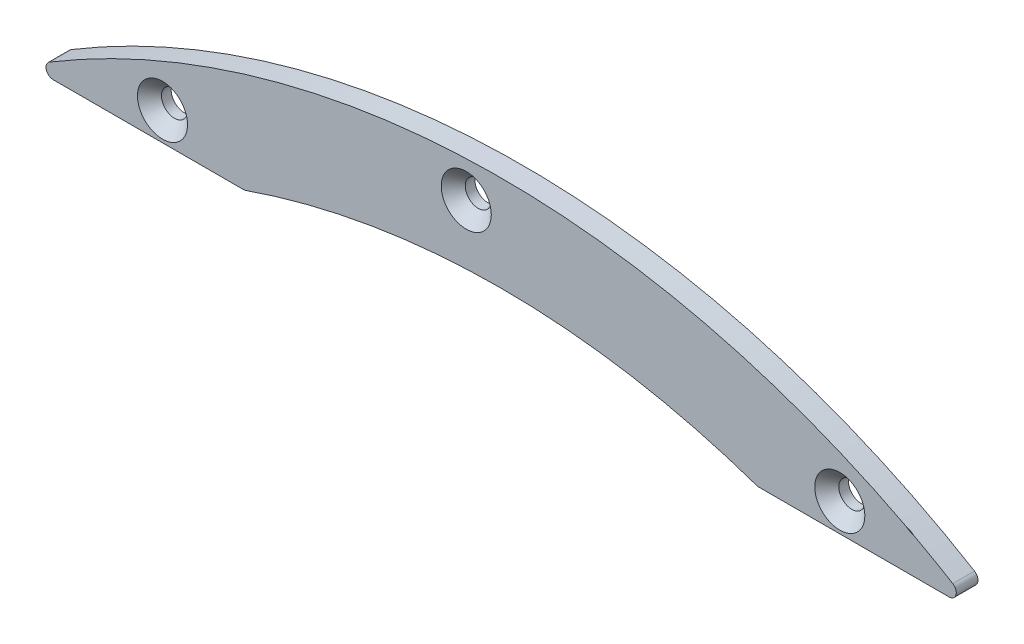
ISO-10303-21;
HEADER;
FILE_DESCRIPTION(('STEP AP214'),'2;1');
FILE_NAME('part.step','',(''),(''),'','','');
FILE_SCHEMA(('AUTOMOTIVE_DESIGN { 1 0 10303 214 1 1 1 1 }'));
ENDSEC;
DATA;
#1=APPLICATION_CONTEXT('core data for automotive mechanical design processes');
#2=APPLICATION_PROTOCOL_DEFINITION('international standard','automotive_design',2000,#1);
#3=PRODUCT_CONTEXT('',#1,'mechanical');
#4=PRODUCT('Part','Part','',(#3));
#5=PRODUCT_RELATED_PRODUCT_CATEGORY('part','',(#4));
#6=PRODUCT_DEFINITION_FORMATION('','',#4);
#7=PRODUCT_DEFINITION_CONTEXT('part definition',#1,'design');
#8=PRODUCT_DEFINITION('design','',#6,#7);
#9=PRODUCT_DEFINITION_SHAPE('','',#8);
#10=(LENGTH_UNIT() NAMED_UNIT(*) SI_UNIT(.MILLI.,.METRE.));
#11=(NAMED_UNIT(*) PLANE_ANGLE_UNIT() SI_UNIT($,.RADIAN.));
#12=(NAMED_UNIT(*) SI_UNIT($,.STERADIAN.) SOLID_ANGLE_UNIT());
#13=UNCERTAINTY_MEASURE_WITH_UNIT(LENGTH_MEASURE(1.E-05),#10,'distance_accuracy_value','');
#14=(GEOMETRIC_REPRESENTATION_CONTEXT(3) GLOBAL_UNCERTAINTY_ASSIGNED_CONTEXT((#13)) GLOBAL_UNIT_ASSIGNED_CONTEXT((#10,
#11,#12)) REPRESENTATION_CONTEXT('',''));
#15=CARTESIAN_POINT('',(0.,0.,0.));
#16=DIRECTION('',(0.,0.,1.));
#17=DIRECTION('',(1.,0.,0.));
#18=AXIS2_PLACEMENT_3D('',#15,#16,#17);
#19=CARTESIAN_POINT('',(0.,0.,3.75));
#20=DIRECTION('',(0.,0.,-1.));
#21=DIRECTION('',(-1.,0.,0.));
#22=AXIS2_PLACEMENT_3D('',#19,#20,#21);
#23=CYLINDRICAL_SURFACE('',#22,269.460029069767);
#24=CARTESIAN_POINT('',(0.,0.,-3.75));
#25=DIRECTION('',(0.,0.,-1.));
#26=DIRECTION('',(1.,0.,0.));
#27=AXIS2_PLACEMENT_3D('',#24,#25,#26);
#28=CIRCLE('',#27,269.460029069767);
#29=CARTESIAN_POINT('',(-88.6498780151052,254.460029069767,-3.75));
#30=VERTEX_POINT('',#29);
#31=CARTESIAN_POINT('',(88.6498780151052,254.460029069767,-3.75));
#32=VERTEX_POINT('',#31);
#33=EDGE_CURVE('E245',#30,#32,#28,.T.);
#34=ORIENTED_EDGE('',*,*,#33,.T.);
#35=DIRECTION('',(0.,0.,-1.));
#36=VECTOR('',#35,1.);
#37=CARTESIAN_POINT('',(88.6498780151052,254.460029069767,3.75));
#38=LINE('',#37,#36);
#39=CARTESIAN_POINT('',(88.6498780151052,254.460029069767,3.75));
#40=VERTEX_POINT('',#39);
#41=EDGE_CURVE('E49',#40,#32,#38,.T.);
#42=ORIENTED_EDGE('',*,*,#41,.F.);
#43=CARTESIAN_POINT('',(0.,0.,3.75));
#44=DIRECTION('',(0.,0.,-1.));
#45=DIRECTION('',(1.,0.,0.));
#46=AXIS2_PLACEMENT_3D('',#43,#44,#45);
#47=CIRCLE('',#46,269.460029069767);
#48=CARTESIAN_POINT('',(-88.6498780151052,254.460029069767,3.75));
#49=VERTEX_POINT('',#48);
#50=EDGE_CURVE('E246',#49,#40,#47,.T.);
#51=ORIENTED_EDGE('',*,*,#50,.F.);
#52=DIRECTION('',(0.,0.,-1.));
#53=VECTOR('',#52,1.);
#54=CARTESIAN_POINT('',(-88.6498780151052,254.460029069767,3.75));
#55=LINE('',#54,#53);
#56=EDGE_CURVE('E262',#49,#30,#55,.T.);
#57=ORIENTED_EDGE('',*,*,#56,.T.);
#58=EDGE_LOOP('',(#34,#42,#51,#57));
#59=FACE_BOUND('',#58,.T.);
#60=ADVANCED_FACE('F37',(#59),#23,.F.);
#61=CARTESIAN_POINT('',(88.6498780151052,254.460029069767,3.75));
#62=DIRECTION('',(0.,1.,0.));
#63=DIRECTION('',(-1.,0.,0.));
#64=AXIS2_PLACEMENT_3D('',#61,#62,#63);
#65=PLANE('',#64);
#66=DIRECTION('',(1.,0.,0.));
#67=VECTOR('',#66,1.);
#68=CARTESIAN_POINT('',(88.6498780151052,254.460029069767,-3.75));
#69=LINE('',#68,#67);
#70=CARTESIAN_POINT('',(154.75,254.460029069768,-3.75));
#71=VERTEX_POINT('',#70);
#72=EDGE_CURVE('E265',#32,#71,#69,.T.);
#73=ORIENTED_EDGE('',*,*,#72,.T.);
#74=DIRECTION('',(0.,0.,-1.));
#75=VECTOR('',#74,1.);
#76=CARTESIAN_POINT('',(154.75,254.460029069768,3.75));
#77=LINE('',#76,#75);
#78=CARTESIAN_POINT('',(154.75,254.460029069768,3.75));
#79=VERTEX_POINT('',#78);
#80=EDGE_CURVE('E285',#79,#71,#77,.T.);
#81=ORIENTED_EDGE('',*,*,#80,.F.);
#82=DIRECTION('',(1.,0.,0.));
#83=VECTOR('',#82,1.);
#84=CARTESIAN_POINT('',(88.6498780151052,254.460029069767,3.75));
#85=LINE('',#84,#83);
#86=EDGE_CURVE('E249',#40,#79,#85,.T.);
#87=ORIENTED_EDGE('',*,*,#86,.F.);
#88=ORIENTED_EDGE('',*,*,#41,.T.);
#89=EDGE_LOOP('',(#73,#81,#87,#88));
#90=FACE_BOUND('',#89,.T.);
#91=ADVANCED_FACE('F290',(#90),#65,.F.);
#92=CARTESIAN_POINT('',(154.75,256.960029069768,3.75));
#93=DIRECTION('',(0.,0.,-1.));
#94=DIRECTION('',(-1.,0.,0.));
#95=AXIS2_PLACEMENT_3D('',#92,#93,#94);
#96=CYLINDRICAL_SURFACE('',#95,2.50000000000002);
#97=CARTESIAN_POINT('',(154.75,256.960029069768,-3.75));
#98=DIRECTION('',(0.,0.,1.));
#99=DIRECTION('',(-1.,0.,0.));
#100=AXIS2_PLACEMENT_3D('',#97,#98,#99);
#101=CIRCLE('',#100,2.50000000000002);
#102=CARTESIAN_POINT('',(156.039755175714,259.101647987017,-3.75));
#103=VERTEX_POINT('',#102);
#104=EDGE_CURVE('E267',#71,#103,#101,.T.);
#105=ORIENTED_EDGE('',*,*,#104,.T.);
#106=DIRECTION('',(0.,0.,-1.));
#107=VECTOR('',#106,1.);
#108=CARTESIAN_POINT('',(156.039755175714,259.101647987017,3.75));
#109=LINE('',#108,#107);
#110=CARTESIAN_POINT('',(156.039755175714,259.101647987017,3.75));
#111=VERTEX_POINT('',#110);
#112=EDGE_CURVE('E282',#111,#103,#109,.T.);
#113=ORIENTED_EDGE('',*,*,#112,.F.);
#114=CARTESIAN_POINT('',(154.75,256.960029069768,3.75));
#115=DIRECTION('',(0.,0.,1.));
#116=DIRECTION('',(-1.,0.,0.));
#117=AXIS2_PLACEMENT_3D('',#114,#115,#116);
#118=CIRCLE('',#117,2.50000000000002);
#119=EDGE_CURVE('E252',#79,#111,#118,.T.);
#120=ORIENTED_EDGE('',*,*,#119,.F.);
#121=ORIENTED_EDGE('',*,*,#80,.T.);
#122=EDGE_LOOP('',(#105,#113,#120,#121));
#123=FACE_BOUND('',#122,.T.);
#124=ADVANCED_FACE('F304',(#123),#96,.T.);
#125=CARTESIAN_POINT('',(0.,0.,3.75));
#126=DIRECTION('',(0.,0.,-1.));
#127=DIRECTION('',(-1.,0.,0.));
#128=AXIS2_PLACEMENT_3D('',#125,#126,#127);
#129=CYLINDRICAL_SURFACE('',#128,302.460029069768);
#130=CARTESIAN_POINT('',(0.,0.,3.75));
#131=DIRECTION('',(0.,0.,1.));
#132=DIRECTION('',(1.,0.,0.));
#133=AXIS2_PLACEMENT_3D('',#130,#131,#132);
#134=CIRCLE('',#133,302.460029069768);
#135=CARTESIAN_POINT('',(139.908199105441,268.156232461519,3.75));
#136=VERTEX_POINT('',#135);
#137=CARTESIAN_POINT('',(-156.039755175714,259.101647987017,3.75));
#138=VERTEX_POINT('',#137);
#139=EDGE_CURVE('E254',#136,#138,#134,.T.);
#140=ORIENTED_EDGE('',*,*,#139,.F.);
#141=CARTESIAN_POINT('',(132.619219648402,271.83489798908,8.11158046407223));
#142=CARTESIAN_POINT('',(132.834596791155,271.72982163131,7.92778525092383));
#143=CARTESIAN_POINT('',(133.051087469922,271.623887092947,7.74575499076126));
#144=CARTESIAN_POINT('',(133.486790906237,271.410030936583,7.38603458867117));
#145=CARTESIAN_POINT('',(133.706004415415,271.302108765744,7.20834568721867));
#146=CARTESIAN_POINT('',(134.149335410221,271.083172809987,6.8567892377176));
#147=CARTESIAN_POINT('',(134.373478355662,270.972140943511,6.68296490643369));
#148=CARTESIAN_POINT('',(134.825430855283,270.747550427584,6.34186538690266));
#149=CARTESIAN_POINT('',(135.053240080029,270.633992004812,6.17458961481791));
#150=CARTESIAN_POINT('',(135.518238879471,270.401451885659,5.8444821739536));
#151=CARTESIAN_POINT('',(135.755524501654,270.282405801571,5.6818303146494));
#152=CARTESIAN_POINT('',(136.235360150961,270.040863552464,5.36701771275158));
#153=CARTESIAN_POINT('',(136.477911111874,269.918366774312,5.21485885137153));
#154=CARTESIAN_POINT('',(136.96815021038,269.669928398661,4.92429978269551));
#155=CARTESIAN_POINT('',(137.215818424359,269.543999711008,4.78585520650044));
#156=CARTESIAN_POINT('',(137.717620099305,269.287960292444,4.52567972805737));
#157=CARTESIAN_POINT('',(137.971750031574,269.157851834266,4.4039399263188));
#158=CARTESIAN_POINT('',(138.365602237278,268.955484783335,4.23378153011675));
#159=CARTESIAN_POINT('',(138.502893573918,268.884811489796,4.17781584787327));
#160=CARTESIAN_POINT('',(138.779385264753,268.74221032141,4.07246100493958));
#161=CARTESIAN_POINT('',(138.918585943761,268.670282232519,4.0230729789231));
#162=CARTESIAN_POINT('',(139.198459564904,268.525385785394,3.93172243105801));
#163=CARTESIAN_POINT('',(139.339128577233,268.452420075009,3.88974375306163));
#164=CARTESIAN_POINT('',(139.622055436372,268.305378706963,3.8137966635688));
#165=CARTESIAN_POINT('',(139.764313370396,268.231302988297,3.77982869405373));
#166=CARTESIAN_POINT('',(140.094196106521,268.05919092913,3.71144117228976));
#167=CARTESIAN_POINT('',(140.282292330875,267.960805126015,3.68010797734714));
#168=CARTESIAN_POINT('',(140.659867921804,267.762798360052,3.63348297272452));
#169=CARTESIAN_POINT('',(140.849347479274,267.663177225355,3.61819342082291));
#170=CARTESIAN_POINT('',(141.228465171578,267.463335245953,3.60428887464884));
#171=CARTESIAN_POINT('',(141.418103152349,267.363114779461,3.60566428721031));
#172=CARTESIAN_POINT('',(141.796440150967,267.162655601208,3.62501219674104));
#173=CARTESIAN_POINT('',(141.985139510059,267.062416912283,3.64297813884756));
#174=CARTESIAN_POINT('',(142.251451358853,266.920590663808,3.67970358782871));
#175=CARTESIAN_POINT('',(142.329892272458,266.878771756867,3.69193432720546));
#176=CARTESIAN_POINT('',(142.486325107912,266.795285188644,3.71907693156385));
#177=CARTESIAN_POINT('',(142.564317275037,266.7536174505,3.73398715208433));
#178=CARTESIAN_POINT('',(142.871788062169,266.589176741619,3.7980846923937));
#179=CARTESIAN_POINT('',(143.099564268443,266.466975780521,3.85733243677375));
#180=CARTESIAN_POINT('',(143.437545135743,266.285103391195,3.96109326602686));
#181=CARTESIAN_POINT('',(143.549707015845,266.224654897987,3.99820843183271));
#182=CARTESIAN_POINT('',(143.772658966028,266.104317398409,4.07699932231332));
#183=CARTESIAN_POINT('',(143.883449579161,266.044428173023,4.11867317283399));
#184=CARTESIAN_POINT('',(143.993570671845,265.984813081606,4.16244226175853));
#185=B_SPLINE_CURVE_WITH_KNOTS('',3,(#141,#142,#143,#144,#145,#146,#147,#148,#149,#150,#151,
#152,#153,#154,#155,#156,#157,#158,#159,#160,#161,#162,#163,#164,#165,#166,#167,#168,#169,#170,
#171,#172,#173,#174,#175,#176,#177,#178,#179,#180,#181,#182,#183,#184),.UNSPECIFIED.,.F.,.F.,(4,
2,2,2,2,2,2,2,2,2,2,2,2,2,2,2,2,2,2,2,2,4),(0.,0.906044276811157,1.81234448348939,
2.72606745065089,3.6397087683376,4.57353350298285,5.50752522337396,6.43838917044575,
7.36875525695322,7.86136221844393,8.35405404697245,8.84565791526838,9.33728890088448,
9.98041683065181,10.6236352539362,11.266483426935,11.9090777213901,12.1782326675863,
12.4472229876587,13.2416866624306,13.6397529346652,14.0376561656928),.UNSPECIFIED.);
#186=CARTESIAN_POINT('',(142.641129207056,266.712537094566,3.75));
#187=VERTEX_POINT('',#186);
#188=EDGE_CURVE('E11',#136,#187,#185,.T.);
#189=ORIENTED_EDGE('',*,*,#188,.T.);
#190=EDGE_CURVE('E255',#111,#187,#134,.T.);
#191=ORIENTED_EDGE('',*,*,#190,.F.);
#192=ORIENTED_EDGE('',*,*,#112,.T.);
#193=CARTESIAN_POINT('',(0.,0.,-3.75));
#194=DIRECTION('',(0.,0.,1.));
#195=DIRECTION('',(1.,0.,0.));
#196=AXIS2_PLACEMENT_3D('',#193,#194,#195);
#197=CIRCLE('',#196,302.460029069768);
#198=CARTESIAN_POINT('',(-156.039755175714,259.101647987017,-3.75));
#199=VERTEX_POINT('',#198);
#200=EDGE_CURVE('E269',#103,#199,#197,.T.);
#201=ORIENTED_EDGE('',*,*,#200,.T.);
#202=DIRECTION('',(0.,0.,-1.));
#203=VECTOR('',#202,1.);
#204=CARTESIAN_POINT('',(-156.039755175714,259.101647987017,3.75));
#205=LINE('',#204,#203);
#206=EDGE_CURVE('E279',#138,#199,#205,.T.);
#207=ORIENTED_EDGE('',*,*,#206,.F.);
#208=EDGE_LOOP('',(#140,#189,#191,#192,#201,#207));
#209=FACE_BOUND('',#208,.T.);
#210=ADVANCED_FACE('F309',(#209),#129,.T.);
#211=CARTESIAN_POINT('',(-154.75,256.960029069767,3.75));
#212=DIRECTION('',(0.,0.,-1.));
#213=DIRECTION('',(-1.,0.,0.));
#214=AXIS2_PLACEMENT_3D('',#211,#212,#213);
#215=CYLINDRICAL_SURFACE('',#214,2.49999999999999);
#216=CARTESIAN_POINT('',(-154.75,256.960029069767,-3.75));
#217=DIRECTION('',(0.,0.,1.));
#218=DIRECTION('',(1.,0.,0.));
#219=AXIS2_PLACEMENT_3D('',#216,#217,#218);
#220=CIRCLE('',#219,2.49999999999999);
#221=CARTESIAN_POINT('',(-154.75,254.460029069768,-3.75));
#222=VERTEX_POINT('',#221);
#223=EDGE_CURVE('E271',#199,#222,#220,.T.);
#224=ORIENTED_EDGE('',*,*,#223,.T.);
#225=DIRECTION('',(0.,0.,-1.));
#226=VECTOR('',#225,1.);
#227=CARTESIAN_POINT('',(-154.75,254.460029069768,3.75));
#228=LINE('',#227,#226);
#229=CARTESIAN_POINT('',(-154.75,254.460029069768,3.75));
#230=VERTEX_POINT('',#229);
#231=EDGE_CURVE('E276',#230,#222,#228,.T.);
#232=ORIENTED_EDGE('',*,*,#231,.F.);
#233=CARTESIAN_POINT('',(-154.75,256.960029069767,3.75));
#234=DIRECTION('',(0.,0.,1.));
#235=DIRECTION('',(1.,0.,0.));
#236=AXIS2_PLACEMENT_3D('',#233,#234,#235);
#237=CIRCLE('',#236,2.49999999999999);
#238=EDGE_CURVE('E258',#138,#230,#237,.T.);
#239=ORIENTED_EDGE('',*,*,#238,.F.);
#240=ORIENTED_EDGE('',*,*,#206,.T.);
#241=EDGE_LOOP('',(#224,#232,#239,#240));
#242=FACE_BOUND('',#241,.T.);
#243=ADVANCED_FACE('F319',(#242),#215,.T.);
#244=CARTESIAN_POINT('',(-154.75,254.460029069768,3.75));
#245=DIRECTION('',(0.,1.,0.));
#246=DIRECTION('',(-1.,0.,0.));
#247=AXIS2_PLACEMENT_3D('',#244,#245,#246);
#248=PLANE('',#247);
#249=DIRECTION('',(1.,0.,0.));
#250=VECTOR('',#249,1.);
#251=CARTESIAN_POINT('',(-154.75,254.460029069768,-3.75));
#252=LINE('',#251,#250);
#253=EDGE_CURVE('E250',#222,#30,#252,.T.);
#254=ORIENTED_EDGE('',*,*,#253,.T.);
#255=ORIENTED_EDGE('',*,*,#56,.F.);
#256=DIRECTION('',(1.,0.,0.));
#257=VECTOR('',#256,1.);
#258=CARTESIAN_POINT('',(-154.75,254.460029069768,3.75));
#259=LINE('',#258,#257);
#260=EDGE_CURVE('E260',#230,#49,#259,.T.);
#261=ORIENTED_EDGE('',*,*,#260,.F.);
#262=ORIENTED_EDGE('',*,*,#231,.T.);
#263=EDGE_LOOP('',(#254,#255,#261,#262));
#264=FACE_BOUND('',#263,.T.);
#265=ADVANCED_FACE('F317',(#264),#248,.F.);
#266=CARTESIAN_POINT('',(0.,0.,3.75));
#267=DIRECTION('',(0.,0.,1.));
#268=DIRECTION('',(1.,0.,0.));
#269=AXIS2_PLACEMENT_3D('',#266,#267,#268);
#270=PLANE('',#269);
#271=CARTESIAN_POINT('',(-12.0579457489201,289.731675965508,3.75));
#272=DIRECTION('',(0.,0.,1.));
#273=DIRECTION('',(1.,0.,0.));
#274=AXIS2_PLACEMENT_3D('',#271,#272,#273);
#275=CIRCLE('',#274,8.65);
#276=CARTESIAN_POINT('',(-3.40794574892014,289.731675965508,3.75));
#277=VERTEX_POINT('',#276);
#278=EDGE_CURVE('E206',#277,#277,#275,.T.);
#279=ORIENTED_EDGE('',*,*,#278,.F.);
#280=EDGE_LOOP('',(#279));
#281=FACE_BOUND('',#280,.T.);
#282=CARTESIAN_POINT('',(117.,264.213736206127,3.75));
#283=DIRECTION('',(0.,0.,1.));
#284=DIRECTION('',(1.,0.,0.));
#285=AXIS2_PLACEMENT_3D('',#282,#283,#284);
#286=CIRCLE('',#285,8.65000000000001);
#287=CARTESIAN_POINT('',(125.65,264.213736206127,3.75));
#288=VERTEX_POINT('',#287);
#289=EDGE_CURVE('E226',#288,#288,#286,.T.);
#290=ORIENTED_EDGE('',*,*,#289,.F.);
#291=EDGE_LOOP('',(#290));
#292=FACE_BOUND('',#291,.T.);
#293=CARTESIAN_POINT('',(-117.,264.213736206127,3.75));
#294=DIRECTION('',(0.,0.,1.));
#295=DIRECTION('',(1.,0.,0.));
#296=AXIS2_PLACEMENT_3D('',#293,#294,#295);
#297=CIRCLE('',#296,8.65000000000001);
#298=CARTESIAN_POINT('',(-108.35,264.213736206127,3.75));
#299=VERTEX_POINT('',#298);
#300=EDGE_CURVE('E235',#299,#299,#297,.T.);
#301=ORIENTED_EDGE('',*,*,#300,.F.);
#302=EDGE_LOOP('',(#301));
#303=FACE_BOUND('',#302,.T.);
#304=CARTESIAN_POINT('',(145.25,274.959736206127,3.75));
#305=DIRECTION('',(0.,0.,1.));
#306=DIRECTION('',(1.,0.,0.));
#307=AXIS2_PLACEMENT_3D('',#304,#305,#306);
#308=CIRCLE('',#307,8.64999999999999);
#309=EDGE_CURVE('E63',#136,#187,#308,.T.);
#310=ORIENTED_EDGE('',*,*,#309,.F.);
#311=ORIENTED_EDGE('',*,*,#139,.T.);
#312=ORIENTED_EDGE('',*,*,#238,.T.);
#313=ORIENTED_EDGE('',*,*,#260,.T.);
#314=ORIENTED_EDGE('',*,*,#50,.T.);
#315=ORIENTED_EDGE('',*,*,#86,.T.);
#316=ORIENTED_EDGE('',*,*,#119,.T.);
#317=ORIENTED_EDGE('',*,*,#190,.T.);
#318=EDGE_LOOP('',(#310,#311,#312,#313,#314,#315,#316,#317));
#319=FACE_BOUND('',#318,.T.);
#320=ADVANCED_FACE('F312',(#281,#292,#303,#319),#270,.T.);
#321=CARTESIAN_POINT('',(0.,0.,-3.75));
#322=DIRECTION('',(0.,0.,1.));
#323=DIRECTION('',(1.,0.,0.));
#324=AXIS2_PLACEMENT_3D('',#321,#322,#323);
#325=PLANE('',#324);
#326=DIRECTION('',(-0.707106781186557,-0.707106781186538,0.));
#327=VECTOR('',#326,1.);
#328=CARTESIAN_POINT('',(-33.1985948574976,273.970586651553,-3.75));
#329=LINE('',#328,#327);
#330=CARTESIAN_POINT('',(-28.9559541703783,278.213227338672,-3.75));
#331=VERTEX_POINT('',#330);
#332=CARTESIAN_POINT('',(-33.1985948574976,273.970586651553,-3.75));
#333=VERTEX_POINT('',#332);
#334=EDGE_CURVE('E188',#331,#333,#329,.T.);
#335=ORIENTED_EDGE('',*,*,#334,.F.);
#336=CARTESIAN_POINT('',(-27.1881872174119,279.980994291639,-3.75));
#337=DIRECTION('',(0.,0.,-1.));
#338=DIRECTION('',(1.,0.,0.));
#339=AXIS2_PLACEMENT_3D('',#336,#337,#338);
#340=CIRCLE('',#339,2.50000000000002);
#341=CARTESIAN_POINT('',(-25.4204202644455,281.748761244605,-3.75));
#342=VERTEX_POINT('',#341);
#343=EDGE_CURVE('E56',#342,#331,#340,.T.);
#344=ORIENTED_EDGE('',*,*,#343,.F.);
#345=DIRECTION('',(0.707106781186543,-0.707106781186552,0.));
#346=VECTOR('',#345,1.);
#347=CARTESIAN_POINT('',(-25.4204202644455,281.748761244605,-3.75));
#348=LINE('',#347,#346);
#349=CARTESIAN_POINT('',(-36.7341287634302,293.06246974359,-3.75));
#350=VERTEX_POINT('',#349);
#351=EDGE_CURVE('E168',#350,#342,#348,.T.);
#352=ORIENTED_EDGE('',*,*,#351,.F.);
#353=CARTESIAN_POINT('',(-38.5018957163966,291.294702790624,-3.75));
#354=DIRECTION('',(0.,0.,-1.));
#355=DIRECTION('',(1.,0.,0.));
#356=AXIS2_PLACEMENT_3D('',#353,#354,#355);
#357=CIRCLE('',#356,2.50000000000002);
#358=CARTESIAN_POINT('',(-40.269662669363,289.526935837657,-3.75));
#359=VERTEX_POINT('',#358);
#360=EDGE_CURVE('E171',#359,#350,#357,.T.);
#361=ORIENTED_EDGE('',*,*,#360,.F.);
#362=DIRECTION('',(0.707106781186554,0.707106781186541,0.));
#363=VECTOR('',#362,1.);
#364=CARTESIAN_POINT('',(-40.269662669363,289.526935837657,-3.75));
#365=LINE('',#364,#363);
#366=CARTESIAN_POINT('',(-44.5123033564823,285.284295150538,-3.75));
#367=VERTEX_POINT('',#366);
#368=EDGE_CURVE('E199',#367,#359,#365,.T.);
#369=ORIENTED_EDGE('',*,*,#368,.F.);
#370=CARTESIAN_POINT('',(-46.2800703094486,283.516528197572,-3.75));
#371=DIRECTION('',(0.,0.,-1.));
#372=DIRECTION('',(1.,0.,0.));
#373=AXIS2_PLACEMENT_3D('',#370,#371,#372);
#374=CIRCLE('',#373,2.49999999999998);
#375=CARTESIAN_POINT('',(-48.047837262415,281.748761244605,-3.75));
#376=VERTEX_POINT('',#375);
#377=EDGE_CURVE('E196',#376,#367,#374,.T.);
#378=ORIENTED_EDGE('',*,*,#377,.F.);
#379=DIRECTION('',(-0.707106781186542,0.707106781186553,0.));
#380=VECTOR('',#379,1.);
#381=CARTESIAN_POINT('',(-48.047837262415,281.748761244605,-3.75));
#382=LINE('',#381,#380);
#383=CARTESIAN_POINT('',(-36.7341287634303,270.435052745621,-3.75));
#384=VERTEX_POINT('',#383);
#385=EDGE_CURVE('E193',#384,#376,#382,.T.);
#386=ORIENTED_EDGE('',*,*,#385,.F.);
#387=CARTESIAN_POINT('',(-34.966361810464,272.202819698587,-3.75));
#388=DIRECTION('',(0.,0.,-1.));
#389=DIRECTION('',(1.,0.,0.));
#390=AXIS2_PLACEMENT_3D('',#387,#388,#389);
#391=CIRCLE('',#390,2.49999999999998);
#392=EDGE_CURVE('E190',#333,#384,#391,.T.);
#393=ORIENTED_EDGE('',*,*,#392,.F.);
#394=EDGE_LOOP('',(#335,#344,#352,#361,#369,#378,#386,#393));
#395=FACE_BOUND('',#394,.T.);
#396=CARTESIAN_POINT('',(-12.0579457489201,289.731675965508,-3.75));
#397=DIRECTION('',(0.,0.,1.));
#398=DIRECTION('',(1.,0.,0.));
#399=AXIS2_PLACEMENT_3D('',#396,#397,#398);
#400=CIRCLE('',#399,4.5);
#401=CARTESIAN_POINT('',(-7.55794574892014,289.731675965508,-3.75));
#402=VERTEX_POINT('',#401);
#403=EDGE_CURVE('E223',#402,#402,#400,.T.);
#404=ORIENTED_EDGE('',*,*,#403,.T.);
#405=EDGE_LOOP('',(#404));
#406=FACE_BOUND('',#405,.T.);
#407=CARTESIAN_POINT('',(117.,264.213736206127,-3.75));
#408=DIRECTION('',(0.,0.,1.));
#409=DIRECTION('',(1.,0.,0.));
#410=AXIS2_PLACEMENT_3D('',#407,#408,#409);
#411=CIRCLE('',#410,4.5);
#412=CARTESIAN_POINT('',(121.5,264.213736206127,-3.75));
#413=VERTEX_POINT('',#412);
#414=EDGE_CURVE('E232',#413,#413,#411,.T.);
#415=ORIENTED_EDGE('',*,*,#414,.T.);
#416=EDGE_LOOP('',(#415));
#417=FACE_BOUND('',#416,.T.);
#418=CARTESIAN_POINT('',(-117.,264.213736206127,-3.75));
#419=DIRECTION('',(0.,0.,1.));
#420=DIRECTION('',(1.,0.,0.));
#421=AXIS2_PLACEMENT_3D('',#418,#419,#420);
#422=CIRCLE('',#421,4.5);
#423=CARTESIAN_POINT('',(-112.5,264.213736206127,-3.75));
#424=VERTEX_POINT('',#423);
#425=EDGE_CURVE('E241',#424,#424,#422,.T.);
#426=ORIENTED_EDGE('',*,*,#425,.T.);
#427=EDGE_LOOP('',(#426));
#428=FACE_BOUND('',#427,.T.);
#429=ORIENTED_EDGE('',*,*,#33,.F.);
#430=ORIENTED_EDGE('',*,*,#253,.F.);
#431=ORIENTED_EDGE('',*,*,#223,.F.);
#432=ORIENTED_EDGE('',*,*,#200,.F.);
#433=ORIENTED_EDGE('',*,*,#104,.F.);
#434=ORIENTED_EDGE('',*,*,#72,.F.);
#435=EDGE_LOOP('',(#429,#430,#431,#432,#433,#434));
#436=FACE_BOUND('',#435,.T.);
#437=ADVANCED_FACE('F298',(#395,#406,#417,#428,#436),#325,.F.);
#438=CARTESIAN_POINT('',(145.25,274.959736206127,3.75));
#439=DIRECTION('',(0.,0.,1.));
#440=DIRECTION('',(1.,0.,0.));
#441=AXIS2_PLACEMENT_3D('',#438,#439,#440);
#442=CONICAL_SURFACE('',#441,8.64999999999999,0.785398163397447);
#443=ORIENTED_EDGE('',*,*,#309,.T.);
#444=ORIENTED_EDGE('',*,*,#188,.F.);
#445=EDGE_LOOP('',(#443,#444));
#446=FACE_BOUND('',#445,.T.);
#447=ADVANCED_FACE('F362',(#446),#442,.F.);
#448=CARTESIAN_POINT('',(-117.,264.213736206127,3.75));
#449=DIRECTION('',(0.,0.,1.));
#450=DIRECTION('',(1.,0.,0.));
#451=AXIS2_PLACEMENT_3D('',#448,#449,#450);
#452=CYLINDRICAL_SURFACE('',#451,4.5);
#453=ORIENTED_EDGE('',*,*,#425,.F.);
#454=EDGE_LOOP('',(#453));
#455=FACE_BOUND('',#454,.T.);
#456=CARTESIAN_POINT('',(-117.,264.213736206127,-0.4));
#457=DIRECTION('',(0.,0.,1.));
#458=DIRECTION('',(1.,0.,0.));
#459=AXIS2_PLACEMENT_3D('',#456,#457,#458);
#460=CIRCLE('',#459,4.5);
#461=CARTESIAN_POINT('',(-112.5,264.213736206127,-0.4));
#462=VERTEX_POINT('',#461);
#463=EDGE_CURVE('E238',#462,#462,#460,.T.);
#464=ORIENTED_EDGE('',*,*,#463,.T.);
#465=EDGE_LOOP('',(#464));
#466=FACE_BOUND('',#465,.T.);
#467=ADVANCED_FACE('F367',(#455,#466),#452,.F.);
#468=CARTESIAN_POINT('',(-117.,264.213736206127,3.75));
#469=DIRECTION('',(0.,0.,1.));
#470=DIRECTION('',(1.,0.,0.));
#471=AXIS2_PLACEMENT_3D('',#468,#469,#470);
#472=CONICAL_SURFACE('',#471,8.65000000000001,0.785398163397449);
#473=ORIENTED_EDGE('',*,*,#463,.F.);
#474=EDGE_LOOP('',(#473));
#475=FACE_BOUND('',#474,.T.);
#476=ORIENTED_EDGE('',*,*,#300,.T.);
#477=EDGE_LOOP('',(#476));
#478=FACE_BOUND('',#477,.T.);
#479=ADVANCED_FACE('F375',(#475,#478),#472,.F.);
#480=CARTESIAN_POINT('',(117.,264.213736206127,3.75));
#481=DIRECTION('',(0.,0.,1.));
#482=DIRECTION('',(1.,0.,0.));
#483=AXIS2_PLACEMENT_3D('',#480,#481,#482);
#484=CYLINDRICAL_SURFACE('',#483,4.5);
#485=ORIENTED_EDGE('',*,*,#414,.F.);
#486=EDGE_LOOP('',(#485));
#487=FACE_BOUND('',#486,.T.);
#488=CARTESIAN_POINT('',(117.,264.213736206127,-0.4));
#489=DIRECTION('',(0.,0.,1.));
#490=DIRECTION('',(1.,0.,0.));
#491=AXIS2_PLACEMENT_3D('',#488,#489,#490);
#492=CIRCLE('',#491,4.5);
#493=CARTESIAN_POINT('',(121.5,264.213736206127,-0.4));
#494=VERTEX_POINT('',#493);
#495=EDGE_CURVE('E229',#494,#494,#492,.T.);
#496=ORIENTED_EDGE('',*,*,#495,.T.);
#497=EDGE_LOOP('',(#496));
#498=FACE_BOUND('',#497,.T.);
#499=ADVANCED_FACE('F385',(#487,#498),#484,.F.);
#500=CARTESIAN_POINT('',(117.,264.213736206127,3.75));
#501=DIRECTION('',(0.,0.,1.));
#502=DIRECTION('',(1.,0.,0.));
#503=AXIS2_PLACEMENT_3D('',#500,#501,#502);
#504=CONICAL_SURFACE('',#503,8.65000000000001,0.785398163397449);
#505=ORIENTED_EDGE('',*,*,#495,.F.);
#506=EDGE_LOOP('',(#505));
#507=FACE_BOUND('',#506,.T.);
#508=ORIENTED_EDGE('',*,*,#289,.T.);
#509=EDGE_LOOP('',(#508));
#510=FACE_BOUND('',#509,.T.);
#511=ADVANCED_FACE('F395',(#507,#510),#504,.F.);
#512=CARTESIAN_POINT('',(-12.0579457489201,289.731675965508,3.75));
#513=DIRECTION('',(0.,0.,1.));
#514=DIRECTION('',(1.,0.,0.));
#515=AXIS2_PLACEMENT_3D('',#512,#513,#514);
#516=CYLINDRICAL_SURFACE('',#515,4.5);
#517=ORIENTED_EDGE('',*,*,#403,.F.);
#518=EDGE_LOOP('',(#517));
#519=FACE_BOUND('',#518,.T.);
#520=CARTESIAN_POINT('',(-12.0579457489201,289.731675965508,-0.4));
#521=DIRECTION('',(0.,0.,1.));
#522=DIRECTION('',(1.,0.,0.));
#523=AXIS2_PLACEMENT_3D('',#520,#521,#522);
#524=CIRCLE('',#523,4.5);
#525=CARTESIAN_POINT('',(-7.55794574892014,289.731675965508,-0.4));
#526=VERTEX_POINT('',#525);
#527=EDGE_CURVE('E220',#526,#526,#524,.T.);
#528=ORIENTED_EDGE('',*,*,#527,.T.);
#529=EDGE_LOOP('',(#528));
#530=FACE_BOUND('',#529,.T.);
#531=ADVANCED_FACE('F405',(#519,#530),#516,.F.);
#532=CARTESIAN_POINT('',(-12.0579457489201,289.731675965508,3.75));
#533=DIRECTION('',(0.,0.,1.));
#534=DIRECTION('',(1.,0.,0.));
#535=AXIS2_PLACEMENT_3D('',#532,#533,#534);
#536=CONICAL_SURFACE('',#535,8.65,0.785398163397448);
#537=ORIENTED_EDGE('',*,*,#527,.F.);
#538=EDGE_LOOP('',(#537));
#539=FACE_BOUND('',#538,.T.);
#540=ORIENTED_EDGE('',*,*,#278,.T.);
#541=EDGE_LOOP('',(#540));
#542=FACE_BOUND('',#541,.T.);
#543=ADVANCED_FACE('F415',(#539,#542),#536,.F.);
#544=CARTESIAN_POINT('',(-27.1881872174119,279.980994291639,-0.75));
#545=DIRECTION('',(0.,0.,-1.));
#546=DIRECTION('',(-1.,0.,0.));
#547=AXIS2_PLACEMENT_3D('',#544,#545,#546);
#548=CYLINDRICAL_SURFACE('',#547,2.50000000000002);
#549=ORIENTED_EDGE('',*,*,#343,.T.);
#550=DIRECTION('',(0.,0.,-1.));
#551=VECTOR('',#550,1.);
#552=CARTESIAN_POINT('',(-28.9559541703783,278.213227338672,-0.75));
#553=LINE('',#552,#551);
#554=CARTESIAN_POINT('',(-28.9559541703783,278.213227338672,-0.75));
#555=VERTEX_POINT('',#554);
#556=EDGE_CURVE('E145',#555,#331,#553,.T.);
#557=ORIENTED_EDGE('',*,*,#556,.F.);
#558=CARTESIAN_POINT('',(-27.1881872174119,279.980994291639,-0.75));
#559=DIRECTION('',(0.,0.,-1.));
#560=DIRECTION('',(1.,0.,0.));
#561=AXIS2_PLACEMENT_3D('',#558,#559,#560);
#562=CIRCLE('',#561,2.50000000000002);
#563=CARTESIAN_POINT('',(-25.4204202644455,281.748761244605,-0.75));
#564=VERTEX_POINT('',#563);
#565=EDGE_CURVE('E149',#564,#555,#562,.T.);
#566=ORIENTED_EDGE('',*,*,#565,.F.);
#567=DIRECTION('',(0.,0.,-1.));
#568=VECTOR('',#567,1.);
#569=CARTESIAN_POINT('',(-25.4204202644455,281.748761244605,-0.75));
#570=LINE('',#569,#568);
#571=EDGE_CURVE('E204',#564,#342,#570,.T.);
#572=ORIENTED_EDGE('',*,*,#571,.T.);
#573=EDGE_LOOP('',(#549,#557,#566,#572));
#574=FACE_BOUND('',#573,.T.);
#575=ADVANCED_FACE('F147',(#574),#548,.F.);
#576=CARTESIAN_POINT('',(-25.4204202644455,281.748761244605,-0.75));
#577=DIRECTION('',(0.707106781186552,0.707106781186543,0.));
#578=DIRECTION('',(-0.707106781186543,0.707106781186552,0.));
#579=AXIS2_PLACEMENT_3D('',#576,#577,#578);
#580=PLANE('',#579);
#581=ORIENTED_EDGE('',*,*,#351,.T.);
#582=ORIENTED_EDGE('',*,*,#571,.F.);
#583=DIRECTION('',(0.707106781186543,-0.707106781186552,0.));
#584=VECTOR('',#583,1.);
#585=CARTESIAN_POINT('',(-25.4204202644455,281.748761244605,-0.75));
#586=LINE('',#585,#584);
#587=CARTESIAN_POINT('',(-36.7341287634302,293.06246974359,-0.75));
#588=VERTEX_POINT('',#587);
#589=EDGE_CURVE('E155',#588,#564,#586,.T.);
#590=ORIENTED_EDGE('',*,*,#589,.F.);
#591=DIRECTION('',(0.,0.,-1.));
#592=VECTOR('',#591,1.);
#593=CARTESIAN_POINT('',(-36.7341287634302,293.06246974359,-0.75));
#594=LINE('',#593,#592);
#595=EDGE_CURVE('E207',#588,#350,#594,.T.);
#596=ORIENTED_EDGE('',*,*,#595,.T.);
#597=EDGE_LOOP('',(#581,#582,#590,#596));
#598=FACE_BOUND('',#597,.T.);
#599=ADVANCED_FACE('F441',(#598),#580,.F.);
#600=CARTESIAN_POINT('',(-38.5018957163966,291.294702790624,-0.75));
#601=DIRECTION('',(0.,0.,-1.));
#602=DIRECTION('',(-1.,0.,0.));
#603=AXIS2_PLACEMENT_3D('',#600,#601,#602);
#604=CYLINDRICAL_SURFACE('',#603,2.50000000000002);
#605=ORIENTED_EDGE('',*,*,#360,.T.);
#606=ORIENTED_EDGE('',*,*,#595,.F.);
#607=CARTESIAN_POINT('',(-38.5018957163966,291.294702790624,-0.75));
#608=DIRECTION('',(0.,0.,-1.));
#609=DIRECTION('',(1.,0.,0.));
#610=AXIS2_PLACEMENT_3D('',#607,#608,#609);
#611=CIRCLE('',#610,2.50000000000002);
#612=CARTESIAN_POINT('',(-40.269662669363,289.526935837657,-0.75));
#613=VERTEX_POINT('',#612);
#614=EDGE_CURVE('E184',#613,#588,#611,.T.);
#615=ORIENTED_EDGE('',*,*,#614,.F.);
#616=DIRECTION('',(0.,0.,-1.));
#617=VECTOR('',#616,1.);
#618=CARTESIAN_POINT('',(-40.269662669363,289.526935837657,-0.75));
#619=LINE('',#618,#617);
#620=EDGE_CURVE('E209',#613,#359,#619,.T.);
#621=ORIENTED_EDGE('',*,*,#620,.T.);
#622=EDGE_LOOP('',(#605,#606,#615,#621));
#623=FACE_BOUND('',#622,.T.);
#624=ADVANCED_FACE('F450',(#623),#604,.F.);
#625=CARTESIAN_POINT('',(-40.269662669363,289.526935837657,-0.75));
#626=DIRECTION('',(-0.707106781186541,0.707106781186554,0.));
#627=DIRECTION('',(-0.707106781186554,-0.707106781186541,0.));
#628=AXIS2_PLACEMENT_3D('',#625,#626,#627);
#629=PLANE('',#628);
#630=ORIENTED_EDGE('',*,*,#368,.T.);
#631=ORIENTED_EDGE('',*,*,#620,.F.);
#632=DIRECTION('',(0.707106781186554,0.707106781186541,0.));
#633=VECTOR('',#632,1.);
#634=CARTESIAN_POINT('',(-40.269662669363,289.526935837657,-0.75));
#635=LINE('',#634,#633);
#636=CARTESIAN_POINT('',(-44.5123033564823,285.284295150538,-0.75));
#637=VERTEX_POINT('',#636);
#638=EDGE_CURVE('E181',#637,#613,#635,.T.);
#639=ORIENTED_EDGE('',*,*,#638,.F.);
#640=DIRECTION('',(0.,0.,-1.));
#641=VECTOR('',#640,1.);
#642=CARTESIAN_POINT('',(-44.5123033564823,285.284295150538,-0.75));
#643=LINE('',#642,#641);
#644=EDGE_CURVE('E211',#637,#367,#643,.T.);
#645=ORIENTED_EDGE('',*,*,#644,.T.);
#646=EDGE_LOOP('',(#630,#631,#639,#645));
#647=FACE_BOUND('',#646,.T.);
#648=ADVANCED_FACE('F460',(#647),#629,.F.);
#649=CARTESIAN_POINT('',(-46.2800703094486,283.516528197572,-0.75));
#650=DIRECTION('',(0.,0.,-1.));
#651=DIRECTION('',(-1.,0.,0.));
#652=AXIS2_PLACEMENT_3D('',#649,#650,#651);
#653=CYLINDRICAL_SURFACE('',#652,2.49999999999998);
#654=ORIENTED_EDGE('',*,*,#377,.T.);
#655=ORIENTED_EDGE('',*,*,#644,.F.);
#656=CARTESIAN_POINT('',(-46.2800703094486,283.516528197572,-0.75));
#657=DIRECTION('',(0.,0.,-1.));
#658=DIRECTION('',(1.,0.,0.));
#659=AXIS2_PLACEMENT_3D('',#656,#657,#658);
#660=CIRCLE('',#659,2.49999999999998);
#661=CARTESIAN_POINT('',(-48.047837262415,281.748761244605,-0.75));
#662=VERTEX_POINT('',#661);
#663=EDGE_CURVE('E178',#662,#637,#660,.T.);
#664=ORIENTED_EDGE('',*,*,#663,.F.);
#665=DIRECTION('',(0.,0.,-1.));
#666=VECTOR('',#665,1.);
#667=CARTESIAN_POINT('',(-48.047837262415,281.748761244605,-0.75));
#668=LINE('',#667,#666);
#669=EDGE_CURVE('E213',#662,#376,#668,.T.);
#670=ORIENTED_EDGE('',*,*,#669,.T.);
#671=EDGE_LOOP('',(#654,#655,#664,#670));
#672=FACE_BOUND('',#671,.T.);
#673=ADVANCED_FACE('F470',(#672),#653,.F.);
#674=CARTESIAN_POINT('',(-48.047837262415,281.748761244605,-0.75));
#675=DIRECTION('',(-0.707106781186553,-0.707106781186542,0.));
#676=DIRECTION('',(0.707106781186542,-0.707106781186553,0.));
#677=AXIS2_PLACEMENT_3D('',#674,#675,#676);
#678=PLANE('',#677);
#679=ORIENTED_EDGE('',*,*,#385,.T.);
#680=ORIENTED_EDGE('',*,*,#669,.F.);
#681=DIRECTION('',(-0.707106781186542,0.707106781186553,0.));
#682=VECTOR('',#681,1.);
#683=CARTESIAN_POINT('',(-48.047837262415,281.748761244605,-0.75));
#684=LINE('',#683,#682);
#685=CARTESIAN_POINT('',(-36.7341287634303,270.435052745621,-0.75));
#686=VERTEX_POINT('',#685);
#687=EDGE_CURVE('E175',#686,#662,#684,.T.);
#688=ORIENTED_EDGE('',*,*,#687,.F.);
#689=DIRECTION('',(0.,0.,-1.));
#690=VECTOR('',#689,1.);
#691=CARTESIAN_POINT('',(-36.7341287634303,270.435052745621,-0.75));
#692=LINE('',#691,#690);
#693=EDGE_CURVE('E215',#686,#384,#692,.T.);
#694=ORIENTED_EDGE('',*,*,#693,.T.);
#695=EDGE_LOOP('',(#679,#680,#688,#694));
#696=FACE_BOUND('',#695,.T.);
#697=ADVANCED_FACE('F480',(#696),#678,.F.);
#698=CARTESIAN_POINT('',(-34.966361810464,272.202819698587,-0.75));
#699=DIRECTION('',(0.,0.,-1.));
#700=DIRECTION('',(-1.,0.,0.));
#701=AXIS2_PLACEMENT_3D('',#698,#699,#700);
#702=CYLINDRICAL_SURFACE('',#701,2.49999999999998);
#703=ORIENTED_EDGE('',*,*,#392,.T.);
#704=ORIENTED_EDGE('',*,*,#693,.F.);
#705=CARTESIAN_POINT('',(-34.966361810464,272.202819698587,-0.75));
#706=DIRECTION('',(0.,0.,-1.));
#707=DIRECTION('',(1.,0.,0.));
#708=AXIS2_PLACEMENT_3D('',#705,#706,#707);
#709=CIRCLE('',#708,2.49999999999998);
#710=CARTESIAN_POINT('',(-33.1985948574976,273.970586651553,-0.75));
#711=VERTEX_POINT('',#710);
#712=EDGE_CURVE('E163',#711,#686,#709,.T.);
#713=ORIENTED_EDGE('',*,*,#712,.F.);
#714=DIRECTION('',(0.,0.,-1.));
#715=VECTOR('',#714,1.);
#716=CARTESIAN_POINT('',(-33.1985948574976,273.970586651553,-0.75));
#717=LINE('',#716,#715);
#718=EDGE_CURVE('E154',#711,#333,#717,.T.);
#719=ORIENTED_EDGE('',*,*,#718,.T.);
#720=EDGE_LOOP('',(#703,#704,#713,#719));
#721=FACE_BOUND('',#720,.T.);
#722=ADVANCED_FACE('F490',(#721),#702,.F.);
#723=CARTESIAN_POINT('',(-33.1985948574976,273.970586651553,-0.75));
#724=DIRECTION('',(0.707106781186538,-0.707106781186557,0.));
#725=DIRECTION('',(0.707106781186557,0.707106781186538,0.));
#726=AXIS2_PLACEMENT_3D('',#723,#724,#725);
#727=PLANE('',#726);
#728=ORIENTED_EDGE('',*,*,#334,.T.);
#729=ORIENTED_EDGE('',*,*,#718,.F.);
#730=DIRECTION('',(-0.707106781186557,-0.707106781186538,0.));
#731=VECTOR('',#730,1.);
#732=CARTESIAN_POINT('',(-33.1985948574976,273.970586651553,-0.75));
#733=LINE('',#732,#731);
#734=EDGE_CURVE('E158',#555,#711,#733,.T.);
#735=ORIENTED_EDGE('',*,*,#734,.F.);
#736=ORIENTED_EDGE('',*,*,#556,.T.);
#737=EDGE_LOOP('',(#728,#729,#735,#736));
#738=FACE_BOUND('',#737,.T.);
#739=ADVANCED_FACE('F159',(#738),#727,.F.);
#740=CARTESIAN_POINT('',(-27.1881872174119,279.980994291639,-0.75));
#741=DIRECTION('',(0.,0.,1.));
#742=DIRECTION('',(1.,0.,0.));
#743=AXIS2_PLACEMENT_3D('',#740,#741,#742);
#744=PLANE('',#743);
#745=ORIENTED_EDGE('',*,*,#565,.T.);
#746=ORIENTED_EDGE('',*,*,#734,.T.);
#747=ORIENTED_EDGE('',*,*,#712,.T.);
#748=ORIENTED_EDGE('',*,*,#687,.T.);
#749=ORIENTED_EDGE('',*,*,#663,.T.);
#750=ORIENTED_EDGE('',*,*,#638,.T.);
#751=ORIENTED_EDGE('',*,*,#614,.T.);
#752=ORIENTED_EDGE('',*,*,#589,.T.);
#753=EDGE_LOOP('',(#745,#746,#747,#748,#749,#750,#751,#752));
#754=FACE_BOUND('',#753,.T.);
#755=ADVANCED_FACE('F165',(#754),#744,.F.);
#756=CLOSED_SHELL('',(#60,#91,#124,#210,#243,#265,#320,#437,#447,#467,#479,#499,#511,#531,#543,
#575,#599,#624,#648,#673,#697,#722,#739,#755));
#757=MANIFOLD_SOLID_BREP('B2',#756);
#758=ADVANCED_BREP_SHAPE_REPRESENTATION('',(#18,#757),#14);
#759=SHAPE_DEFINITION_REPRESENTATION(#9,#758);
ENDSEC;
END-ISO-10303-21;
